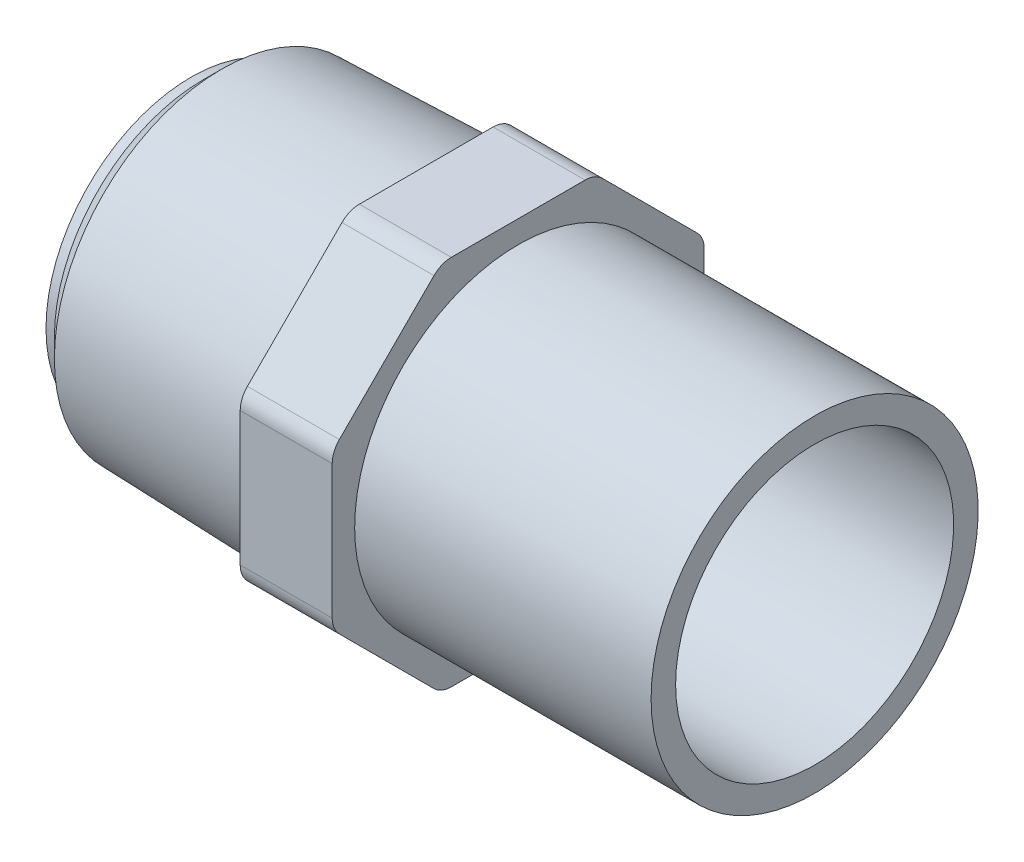
ISO-10303-21;
HEADER;
FILE_DESCRIPTION(('STEP AP214'),'2;1');
FILE_NAME('part.step','',(''),(''),'','','');
FILE_SCHEMA(('AUTOMOTIVE_DESIGN { 1 0 10303 214 1 1 1 1 }'));
ENDSEC;
DATA;
#1=APPLICATION_CONTEXT('core data for automotive mechanical design processes');
#2=APPLICATION_PROTOCOL_DEFINITION('international standard','automotive_design',2000,#1);
#3=PRODUCT_CONTEXT('',#1,'mechanical');
#4=PRODUCT('Part','Part','',(#3));
#5=PRODUCT_RELATED_PRODUCT_CATEGORY('part','',(#4));
#6=PRODUCT_DEFINITION_FORMATION('','',#4);
#7=PRODUCT_DEFINITION_CONTEXT('part definition',#1,'design');
#8=PRODUCT_DEFINITION('design','',#6,#7);
#9=PRODUCT_DEFINITION_SHAPE('','',#8);
#10=(LENGTH_UNIT() NAMED_UNIT(*) SI_UNIT(.MILLI.,.METRE.));
#11=(NAMED_UNIT(*) PLANE_ANGLE_UNIT() SI_UNIT($,.RADIAN.));
#12=(NAMED_UNIT(*) SI_UNIT($,.STERADIAN.) SOLID_ANGLE_UNIT());
#13=UNCERTAINTY_MEASURE_WITH_UNIT(LENGTH_MEASURE(1.E-05),#10,'distance_accuracy_value','');
#14=(GEOMETRIC_REPRESENTATION_CONTEXT(3) GLOBAL_UNCERTAINTY_ASSIGNED_CONTEXT((#13)) GLOBAL_UNIT_ASSIGNED_CONTEXT((#10,
#11,#12)) REPRESENTATION_CONTEXT('',''));
#15=CARTESIAN_POINT('',(0.,0.,0.));
#16=DIRECTION('',(0.,0.,1.));
#17=DIRECTION('',(1.,0.,0.));
#18=AXIS2_PLACEMENT_3D('',#15,#16,#17);
#19=CARTESIAN_POINT('',(-38.,-18.2,18.2));
#20=DIRECTION('',(-1.,0.,0.));
#21=DIRECTION('',(0.,1.,0.));
#22=AXIS2_PLACEMENT_3D('',#19,#20,#21);
#23=PLANE('',#22);
#24=CARTESIAN_POINT('',(-38.,0.,0.));
#25=DIRECTION('',(1.,0.,0.));
#26=DIRECTION('',(0.,0.,-1.));
#27=AXIS2_PLACEMENT_3D('',#24,#25,#26);
#28=CIRCLE('',#27,16.9805562693508);
#29=CARTESIAN_POINT('',(-38.,0.,-16.9805562693508));
#30=VERTEX_POINT('',#29);
#31=EDGE_CURVE('E18',#30,#30,#28,.F.);
#32=ORIENTED_EDGE('',*,*,#31,.F.);
#33=EDGE_LOOP('',(#32));
#34=FACE_BOUND('',#33,.T.);
#35=CARTESIAN_POINT('',(-38.,-15.8,6.54457428549489));
#36=DIRECTION('',(1.,0.,0.));
#37=DIRECTION('',(0.,0.,-1.));
#38=AXIS2_PLACEMENT_3D('',#35,#36,#37);
#39=CIRCLE('',#38,2.40000000000001);
#40=CARTESIAN_POINT('',(-38.,-17.4970562748477,8.24163056034261));
#41=VERTEX_POINT('',#40);
#42=CARTESIAN_POINT('',(-38.,-18.2,6.54457428549489));
#43=VERTEX_POINT('',#42);
#44=EDGE_CURVE('E235',#41,#43,#39,.T.);
#45=ORIENTED_EDGE('',*,*,#44,.F.);
#46=DIRECTION('',(0.,-0.707106781186548,-0.707106781186547));
#47=VECTOR('',#46,1.);
#48=CARTESIAN_POINT('',(-38.,-12.8693434175952,12.8693434175952));
#49=LINE('',#48,#47);
#50=CARTESIAN_POINT('',(-38.,-8.24163056034262,17.4970562748477));
#51=VERTEX_POINT('',#50);
#52=EDGE_CURVE('E132',#51,#41,#49,.T.);
#53=ORIENTED_EDGE('',*,*,#52,.F.);
#54=CARTESIAN_POINT('',(-38.,-6.5445742854949,15.8));
#55=DIRECTION('',(1.,0.,0.));
#56=DIRECTION('',(0.,0.,-1.));
#57=AXIS2_PLACEMENT_3D('',#54,#55,#56);
#58=CIRCLE('',#57,2.40000000000002);
#59=CARTESIAN_POINT('',(-38.,-6.5445742854949,18.2));
#60=VERTEX_POINT('',#59);
#61=EDGE_CURVE('E126',#60,#51,#58,.T.);
#62=ORIENTED_EDGE('',*,*,#61,.F.);
#63=DIRECTION('',(0.,-1.,0.));
#64=VECTOR('',#63,1.);
#65=CARTESIAN_POINT('',(-38.,0.,18.2));
#66=LINE('',#65,#64);
#67=CARTESIAN_POINT('',(-38.,6.54457428549489,18.2));
#68=VERTEX_POINT('',#67);
#69=EDGE_CURVE('E131',#68,#60,#66,.T.);
#70=ORIENTED_EDGE('',*,*,#69,.F.);
#71=CARTESIAN_POINT('',(-38.,6.54457428549489,15.8));
#72=DIRECTION('',(1.,0.,0.));
#73=DIRECTION('',(0.,0.,-1.));
#74=AXIS2_PLACEMENT_3D('',#71,#72,#73);
#75=CIRCLE('',#74,2.40000000000003);
#76=CARTESIAN_POINT('',(-38.,8.24163056034262,17.4970562748477));
#77=VERTEX_POINT('',#76);
#78=EDGE_CURVE('E147',#77,#68,#75,.T.);
#79=ORIENTED_EDGE('',*,*,#78,.F.);
#80=DIRECTION('',(0.,-0.707106781186547,0.707106781186548));
#81=VECTOR('',#80,1.);
#82=CARTESIAN_POINT('',(-38.,12.8693434175952,12.8693434175952));
#83=LINE('',#82,#81);
#84=CARTESIAN_POINT('',(-38.,17.4970562748477,8.24163056034262));
#85=VERTEX_POINT('',#84);
#86=EDGE_CURVE('E151',#85,#77,#83,.T.);
#87=ORIENTED_EDGE('',*,*,#86,.F.);
#88=CARTESIAN_POINT('',(-38.,15.8,6.5445742854949));
#89=DIRECTION('',(1.,0.,0.));
#90=DIRECTION('',(0.,0.,-1.));
#91=AXIS2_PLACEMENT_3D('',#88,#89,#90);
#92=CIRCLE('',#91,2.40000000000001);
#93=CARTESIAN_POINT('',(-38.,18.2,6.5445742854949));
#94=VERTEX_POINT('',#93);
#95=EDGE_CURVE('E225',#94,#85,#92,.T.);
#96=ORIENTED_EDGE('',*,*,#95,.F.);
#97=DIRECTION('',(0.,0.,1.));
#98=VECTOR('',#97,1.);
#99=CARTESIAN_POINT('',(-38.,18.2,0.));
#100=LINE('',#99,#98);
#101=CARTESIAN_POINT('',(-38.,18.2,-6.54457428549489));
#102=VERTEX_POINT('',#101);
#103=EDGE_CURVE('E155',#102,#94,#100,.T.);
#104=ORIENTED_EDGE('',*,*,#103,.F.);
#105=CARTESIAN_POINT('',(-38.,15.8,-6.54457428549488));
#106=DIRECTION('',(1.,0.,0.));
#107=DIRECTION('',(0.,0.,-1.));
#108=AXIS2_PLACEMENT_3D('',#105,#106,#107);
#109=CIRCLE('',#108,2.40000000000003);
#110=CARTESIAN_POINT('',(-38.,17.4970562748477,-8.24163056034261));
#111=VERTEX_POINT('',#110);
#112=EDGE_CURVE('E227',#111,#102,#109,.T.);
#113=ORIENTED_EDGE('',*,*,#112,.F.);
#114=DIRECTION('',(0.,0.707106781186548,0.707106781186547));
#115=VECTOR('',#114,1.);
#116=CARTESIAN_POINT('',(-38.,12.8693434175952,-12.8693434175952));
#117=LINE('',#116,#115);
#118=CARTESIAN_POINT('',(-38.,8.24163056034262,-17.4970562748477));
#119=VERTEX_POINT('',#118);
#120=EDGE_CURVE('E159',#119,#111,#117,.T.);
#121=ORIENTED_EDGE('',*,*,#120,.F.);
#122=CARTESIAN_POINT('',(-38.,6.54457428549491,-15.8));
#123=DIRECTION('',(1.,0.,0.));
#124=DIRECTION('',(0.,0.,-1.));
#125=AXIS2_PLACEMENT_3D('',#122,#123,#124);
#126=CIRCLE('',#125,2.39999999999999);
#127=CARTESIAN_POINT('',(-38.,6.54457428549491,-18.2));
#128=VERTEX_POINT('',#127);
#129=EDGE_CURVE('E229',#128,#119,#126,.T.);
#130=ORIENTED_EDGE('',*,*,#129,.F.);
#131=DIRECTION('',(0.,1.,0.));
#132=VECTOR('',#131,1.);
#133=CARTESIAN_POINT('',(-38.,0.,-18.2));
#134=LINE('',#133,#132);
#135=CARTESIAN_POINT('',(-38.,-6.5445742854949,-18.2));
#136=VERTEX_POINT('',#135);
#137=EDGE_CURVE('E163',#136,#128,#134,.T.);
#138=ORIENTED_EDGE('',*,*,#137,.F.);
#139=CARTESIAN_POINT('',(-38.,-6.5445742854949,-15.8));
#140=DIRECTION('',(1.,0.,0.));
#141=DIRECTION('',(0.,0.,-1.));
#142=AXIS2_PLACEMENT_3D('',#139,#140,#141);
#143=CIRCLE('',#142,2.4);
#144=CARTESIAN_POINT('',(-38.,-8.24163056034261,-17.4970562748477));
#145=VERTEX_POINT('',#144);
#146=EDGE_CURVE('E231',#145,#136,#143,.T.);
#147=ORIENTED_EDGE('',*,*,#146,.F.);
#148=DIRECTION('',(0.,0.707106781186547,-0.707106781186548));
#149=VECTOR('',#148,1.);
#150=CARTESIAN_POINT('',(-38.,-12.8693434175952,-12.8693434175952));
#151=LINE('',#150,#149);
#152=CARTESIAN_POINT('',(-38.,-17.4970562748477,-8.24163056034262));
#153=VERTEX_POINT('',#152);
#154=EDGE_CURVE('E167',#153,#145,#151,.T.);
#155=ORIENTED_EDGE('',*,*,#154,.F.);
#156=CARTESIAN_POINT('',(-38.,-15.8,-6.54457428549492));
#157=DIRECTION('',(1.,0.,0.));
#158=DIRECTION('',(0.,0.,-1.));
#159=AXIS2_PLACEMENT_3D('',#156,#157,#158);
#160=CIRCLE('',#159,2.39999999999999);
#161=CARTESIAN_POINT('',(-38.,-18.2,-6.54457428549492));
#162=VERTEX_POINT('',#161);
#163=EDGE_CURVE('E233',#162,#153,#160,.T.);
#164=ORIENTED_EDGE('',*,*,#163,.F.);
#165=DIRECTION('',(0.,0.,-1.));
#166=VECTOR('',#165,1.);
#167=CARTESIAN_POINT('',(-38.,-18.2,0.));
#168=LINE('',#167,#166);
#169=EDGE_CURVE('E171',#43,#162,#168,.T.);
#170=ORIENTED_EDGE('',*,*,#169,.F.);
#171=EDGE_LOOP('',(#45,#53,#62,#70,#79,#87,#96,#104,#113,#121,#130,#138,#147,#155,#164,#170));
#172=FACE_BOUND('',#171,.T.);
#173=ADVANCED_FACE('F15',(#34,#172),#23,.T.);
#174=CARTESIAN_POINT('',(-58.0230979570329,0.,0.));
#175=DIRECTION('',(1.,0.,0.));
#176=DIRECTION('',(0.,0.,-1.));
#177=AXIS2_PLACEMENT_3D('',#174,#175,#176);
#178=CONICAL_SURFACE('',#177,16.3569020429671,0.0311366738555789);
#179=CARTESIAN_POINT('',(-58.0230979570329,0.,0.));
#180=DIRECTION('',(-1.,0.,0.));
#181=DIRECTION('',(0.,1.,0.));
#182=AXIS2_PLACEMENT_3D('',#179,#180,#181);
#183=CIRCLE('',#182,16.3569020429671);
#184=CARTESIAN_POINT('',(-58.0230979570329,16.3569020429671,0.));
#185=VERTEX_POINT('',#184);
#186=EDGE_CURVE('E143',#185,#185,#183,.T.);
#187=ORIENTED_EDGE('',*,*,#186,.F.);
#188=EDGE_LOOP('',(#187));
#189=FACE_BOUND('',#188,.T.);
#190=ORIENTED_EDGE('',*,*,#31,.T.);
#191=EDGE_LOOP('',(#190));
#192=FACE_BOUND('',#191,.T.);
#193=ADVANCED_FACE('F537',(#189,#192),#178,.T.);
#194=CARTESIAN_POINT('',(-29.,-6.5445742854949,15.8));
#195=DIRECTION('',(1.,0.,0.));
#196=DIRECTION('',(0.,0.,-1.));
#197=AXIS2_PLACEMENT_3D('',#194,#195,#196);
#198=CYLINDRICAL_SURFACE('',#197,2.40000000000002);
#199=ORIENTED_EDGE('',*,*,#61,.T.);
#200=DIRECTION('',(1.,0.,0.));
#201=VECTOR('',#200,1.);
#202=CARTESIAN_POINT('',(-38.,-8.24163056034262,17.4970562748477));
#203=LINE('',#202,#201);
#204=CARTESIAN_POINT('',(-29.,-8.24163056034262,17.4970562748477));
#205=VERTEX_POINT('',#204);
#206=EDGE_CURVE('E135',#205,#51,#203,.F.);
#207=ORIENTED_EDGE('',*,*,#206,.F.);
#208=CARTESIAN_POINT('',(-29.,-6.5445742854949,15.8));
#209=DIRECTION('',(1.,0.,0.));
#210=DIRECTION('',(0.,0.,-1.));
#211=AXIS2_PLACEMENT_3D('',#208,#209,#210);
#212=CIRCLE('',#211,2.40000000000002);
#213=CARTESIAN_POINT('',(-29.,-6.5445742854949,18.2));
#214=VERTEX_POINT('',#213);
#215=EDGE_CURVE('E140',#214,#205,#212,.T.);
#216=ORIENTED_EDGE('',*,*,#215,.F.);
#217=DIRECTION('',(1.,0.,0.));
#218=VECTOR('',#217,1.);
#219=CARTESIAN_POINT('',(-38.,-6.54457428549491,18.2));
#220=LINE('',#219,#218);
#221=EDGE_CURVE('E137',#60,#214,#220,.T.);
#222=ORIENTED_EDGE('',*,*,#221,.F.);
#223=EDGE_LOOP('',(#199,#207,#216,#222));
#224=FACE_BOUND('',#223,.T.);
#225=ADVANCED_FACE('F138',(#224),#198,.T.);
#226=CARTESIAN_POINT('',(-38.,-8.24163056034262,17.4970562748477));
#227=DIRECTION('',(0.,-0.707106781186547,0.707106781186548));
#228=DIRECTION('',(0.,-0.707106781186548,-0.707106781186547));
#229=AXIS2_PLACEMENT_3D('',#226,#227,#228);
#230=PLANE('',#229);
#231=ORIENTED_EDGE('',*,*,#52,.T.);
#232=DIRECTION('',(-1.,0.,0.));
#233=VECTOR('',#232,1.);
#234=CARTESIAN_POINT('',(-33.5,-17.4970562748477,8.24163056034261));
#235=LINE('',#234,#233);
#236=CARTESIAN_POINT('',(-29.,-17.4970562748477,8.24163056034261));
#237=VERTEX_POINT('',#236);
#238=EDGE_CURVE('E175',#237,#41,#235,.T.);
#239=ORIENTED_EDGE('',*,*,#238,.F.);
#240=CARTESIAN_POINT('',(-29.,-8.24163056034263,17.4970562748477));
#241=CARTESIAN_POINT('',(-29.,-8.62727329844701,17.1114135367433));
#242=CARTESIAN_POINT('',(-29.,-9.01291603655139,16.7257707986389));
#243=CARTESIAN_POINT('',(-29.,-9.78420151276015,15.9544853224302));
#244=CARTESIAN_POINT('',(-29.,-10.1698442508645,15.5688425843258));
#245=CARTESIAN_POINT('',(-29.,-10.9411297270733,14.7975571081171));
#246=CARTESIAN_POINT('',(-29.,-11.3267724651777,14.4119143700127));
#247=CARTESIAN_POINT('',(-29.,-12.0980579413864,13.6406288938039));
#248=CARTESIAN_POINT('',(-29.,-12.4837006794908,13.2549861556995));
#249=CARTESIAN_POINT('',(-29.,-13.2549861556996,12.4837006794908));
#250=CARTESIAN_POINT('',(-29.,-13.6406288938039,12.0980579413864));
#251=CARTESIAN_POINT('',(-29.,-14.4119143700127,11.3267724651776));
#252=CARTESIAN_POINT('',(-29.,-14.7975571081171,10.9411297270733));
#253=CARTESIAN_POINT('',(-29.,-15.5688425843258,10.1698442508645));
#254=CARTESIAN_POINT('',(-29.,-15.9544853224302,9.78420151276013));
#255=CARTESIAN_POINT('',(-29.,-16.725770798639,9.01291603655137));
#256=CARTESIAN_POINT('',(-29.,-17.1114135367433,8.62727329844699));
#257=CARTESIAN_POINT('',(-29.,-17.4970562748477,8.24163056034261));
#258=B_SPLINE_CURVE_WITH_KNOTS('',3,(#240,#241,#242,#243,#244,#245,#246,#247,#248,#249,#250,
#251,#252,#253,#254,#255,#256,#257),.UNSPECIFIED.,.F.,.F.,(4,2,2,2,2,2,2,2,4),(0.,
1.63614357137373,3.27228714274745,4.90843071412117,6.5445742854949,8.18071785686862,
9.81686142824235,11.4530049996161,13.0891485709898),.UNSPECIFIED.);
#259=EDGE_CURVE('E222',#205,#237,#258,.T.);
#260=ORIENTED_EDGE('',*,*,#259,.F.);
#261=ORIENTED_EDGE('',*,*,#206,.T.);
#262=EDGE_LOOP('',(#231,#239,#260,#261));
#263=FACE_BOUND('',#262,.T.);
#264=ADVANCED_FACE('F369',(#263),#230,.T.);
#265=CARTESIAN_POINT('',(-29.,-15.8,6.54457428549489));
#266=DIRECTION('',(1.,0.,0.));
#267=DIRECTION('',(0.,0.,-1.));
#268=AXIS2_PLACEMENT_3D('',#265,#266,#267);
#269=CYLINDRICAL_SURFACE('',#268,2.40000000000001);
#270=ORIENTED_EDGE('',*,*,#44,.T.);
#271=DIRECTION('',(1.,0.,0.));
#272=VECTOR('',#271,1.);
#273=CARTESIAN_POINT('',(-38.,-18.2,6.54457428549489));
#274=LINE('',#273,#272);
#275=CARTESIAN_POINT('',(-29.,-18.2,6.54457428549489));
#276=VERTEX_POINT('',#275);
#277=EDGE_CURVE('E174',#276,#43,#274,.F.);
#278=ORIENTED_EDGE('',*,*,#277,.F.);
#279=CARTESIAN_POINT('',(-29.,-15.8,6.54457428549489));
#280=DIRECTION('',(1.,0.,0.));
#281=DIRECTION('',(0.,0.,-1.));
#282=AXIS2_PLACEMENT_3D('',#279,#280,#281);
#283=CIRCLE('',#282,2.40000000000001);
#284=EDGE_CURVE('E219',#237,#276,#283,.T.);
#285=ORIENTED_EDGE('',*,*,#284,.F.);
#286=ORIENTED_EDGE('',*,*,#238,.T.);
#287=EDGE_LOOP('',(#270,#278,#285,#286));
#288=FACE_BOUND('',#287,.T.);
#289=ADVANCED_FACE('F370',(#288),#269,.T.);
#290=CARTESIAN_POINT('',(-38.,-18.2,6.54457428549489));
#291=DIRECTION('',(0.,-1.,0.));
#292=DIRECTION('',(0.,0.,-1.));
#293=AXIS2_PLACEMENT_3D('',#290,#291,#292);
#294=PLANE('',#293);
#295=ORIENTED_EDGE('',*,*,#169,.T.);
#296=DIRECTION('',(-1.,0.,0.));
#297=VECTOR('',#296,1.);
#298=CARTESIAN_POINT('',(-33.5,-18.2,-6.54457428549491));
#299=LINE('',#298,#297);
#300=CARTESIAN_POINT('',(-29.,-18.2,-6.54457428549491));
#301=VERTEX_POINT('',#300);
#302=EDGE_CURVE('E173',#301,#162,#299,.T.);
#303=ORIENTED_EDGE('',*,*,#302,.F.);
#304=DIRECTION('',(0.,0.,-1.));
#305=VECTOR('',#304,1.);
#306=CARTESIAN_POINT('',(-29.,-18.2,18.2));
#307=LINE('',#306,#305);
#308=EDGE_CURVE('E218',#276,#301,#307,.T.);
#309=ORIENTED_EDGE('',*,*,#308,.F.);
#310=ORIENTED_EDGE('',*,*,#277,.T.);
#311=EDGE_LOOP('',(#295,#303,#309,#310));
#312=FACE_BOUND('',#311,.T.);
#313=ADVANCED_FACE('F326',(#312),#294,.T.);
#314=CARTESIAN_POINT('',(-29.,-15.8,-6.54457428549492));
#315=DIRECTION('',(1.,0.,0.));
#316=DIRECTION('',(0.,0.,-1.));
#317=AXIS2_PLACEMENT_3D('',#314,#315,#316);
#318=CYLINDRICAL_SURFACE('',#317,2.39999999999999);
#319=ORIENTED_EDGE('',*,*,#163,.T.);
#320=DIRECTION('',(1.,0.,0.));
#321=VECTOR('',#320,1.);
#322=CARTESIAN_POINT('',(-38.,-17.4970562748477,-8.24163056034262));
#323=LINE('',#322,#321);
#324=CARTESIAN_POINT('',(-29.,-17.4970562748477,-8.24163056034262));
#325=VERTEX_POINT('',#324);
#326=EDGE_CURVE('E170',#325,#153,#323,.F.);
#327=ORIENTED_EDGE('',*,*,#326,.F.);
#328=CARTESIAN_POINT('',(-29.,-15.8,-6.54457428549492));
#329=DIRECTION('',(1.,0.,0.));
#330=DIRECTION('',(0.,0.,-1.));
#331=AXIS2_PLACEMENT_3D('',#328,#329,#330);
#332=CIRCLE('',#331,2.39999999999999);
#333=EDGE_CURVE('E215',#301,#325,#332,.T.);
#334=ORIENTED_EDGE('',*,*,#333,.F.);
#335=ORIENTED_EDGE('',*,*,#302,.T.);
#336=EDGE_LOOP('',(#319,#327,#334,#335));
#337=FACE_BOUND('',#336,.T.);
#338=ADVANCED_FACE('F329',(#337),#318,.T.);
#339=CARTESIAN_POINT('',(-38.,-17.4970562748477,-8.24163056034262));
#340=DIRECTION('',(0.,-0.707106781186548,-0.707106781186547));
#341=DIRECTION('',(0.,0.707106781186547,-0.707106781186548));
#342=AXIS2_PLACEMENT_3D('',#339,#340,#341);
#343=PLANE('',#342);
#344=ORIENTED_EDGE('',*,*,#154,.T.);
#345=DIRECTION('',(-1.,0.,0.));
#346=VECTOR('',#345,1.);
#347=CARTESIAN_POINT('',(-33.5,-8.24163056034261,-17.4970562748477));
#348=LINE('',#347,#346);
#349=CARTESIAN_POINT('',(-29.,-8.24163056034261,-17.4970562748477));
#350=VERTEX_POINT('',#349);
#351=EDGE_CURVE('E169',#350,#145,#348,.T.);
#352=ORIENTED_EDGE('',*,*,#351,.F.);
#353=CARTESIAN_POINT('',(-29.,-17.4970562748477,-8.24163056034262));
#354=CARTESIAN_POINT('',(-29.,-17.1114135367433,-8.627273298447));
#355=CARTESIAN_POINT('',(-29.,-16.7257707986389,-9.01291603655138));
#356=CARTESIAN_POINT('',(-29.,-15.9544853224302,-9.78420151276014));
#357=CARTESIAN_POINT('',(-29.,-15.5688425843258,-10.1698442508645));
#358=CARTESIAN_POINT('',(-29.,-14.7975571081171,-10.9411297270733));
#359=CARTESIAN_POINT('',(-29.,-14.4119143700127,-11.3267724651777));
#360=CARTESIAN_POINT('',(-29.,-13.6406288938039,-12.0980579413864));
#361=CARTESIAN_POINT('',(-29.,-13.2549861556995,-12.4837006794908));
#362=CARTESIAN_POINT('',(-29.,-12.4837006794908,-13.2549861556995));
#363=CARTESIAN_POINT('',(-29.,-12.0980579413864,-13.6406288938039));
#364=CARTESIAN_POINT('',(-29.,-11.3267724651776,-14.4119143700127));
#365=CARTESIAN_POINT('',(-29.,-10.9411297270733,-14.7975571081171));
#366=CARTESIAN_POINT('',(-29.,-10.1698442508645,-15.5688425843258));
#367=CARTESIAN_POINT('',(-29.,-9.78420151276012,-15.9544853224302));
#368=CARTESIAN_POINT('',(-29.,-9.01291603655137,-16.725770798639));
#369=CARTESIAN_POINT('',(-29.,-8.62727329844699,-17.1114135367433));
#370=CARTESIAN_POINT('',(-29.,-8.24163056034261,-17.4970562748477));
#371=B_SPLINE_CURVE_WITH_KNOTS('',3,(#353,#354,#355,#356,#357,#358,#359,#360,#361,#362,#363,
#364,#365,#366,#367,#368,#369,#370),.UNSPECIFIED.,.F.,.F.,(4,2,2,2,2,2,2,2,4),(0.,
1.63614357137373,3.27228714274745,4.90843071412118,6.5445742854949,8.18071785686862,
9.81686142824235,11.4530049996161,13.0891485709898),.UNSPECIFIED.);
#372=EDGE_CURVE('E214',#325,#350,#371,.T.);
#373=ORIENTED_EDGE('',*,*,#372,.F.);
#374=ORIENTED_EDGE('',*,*,#326,.T.);
#375=EDGE_LOOP('',(#344,#352,#373,#374));
#376=FACE_BOUND('',#375,.T.);
#377=ADVANCED_FACE('F333',(#376),#343,.T.);
#378=CARTESIAN_POINT('',(-29.,-6.5445742854949,-15.8));
#379=DIRECTION('',(1.,0.,0.));
#380=DIRECTION('',(0.,0.,-1.));
#381=AXIS2_PLACEMENT_3D('',#378,#379,#380);
#382=CYLINDRICAL_SURFACE('',#381,2.4);
#383=ORIENTED_EDGE('',*,*,#146,.T.);
#384=DIRECTION('',(1.,0.,0.));
#385=VECTOR('',#384,1.);
#386=CARTESIAN_POINT('',(-38.,-6.5445742854949,-18.2));
#387=LINE('',#386,#385);
#388=CARTESIAN_POINT('',(-29.,-6.5445742854949,-18.2));
#389=VERTEX_POINT('',#388);
#390=EDGE_CURVE('E166',#389,#136,#387,.F.);
#391=ORIENTED_EDGE('',*,*,#390,.F.);
#392=CARTESIAN_POINT('',(-29.,-6.5445742854949,-15.8));
#393=DIRECTION('',(1.,0.,0.));
#394=DIRECTION('',(0.,0.,-1.));
#395=AXIS2_PLACEMENT_3D('',#392,#393,#394);
#396=CIRCLE('',#395,2.4);
#397=EDGE_CURVE('E211',#350,#389,#396,.T.);
#398=ORIENTED_EDGE('',*,*,#397,.F.);
#399=ORIENTED_EDGE('',*,*,#351,.T.);
#400=EDGE_LOOP('',(#383,#391,#398,#399));
#401=FACE_BOUND('',#400,.T.);
#402=ADVANCED_FACE('F337',(#401),#382,.T.);
#403=CARTESIAN_POINT('',(-38.,-6.5445742854949,-18.2));
#404=DIRECTION('',(0.,0.,-1.));
#405=DIRECTION('',(0.,1.,0.));
#406=AXIS2_PLACEMENT_3D('',#403,#404,#405);
#407=PLANE('',#406);
#408=ORIENTED_EDGE('',*,*,#137,.T.);
#409=DIRECTION('',(-1.,0.,0.));
#410=VECTOR('',#409,1.);
#411=CARTESIAN_POINT('',(-33.5,6.5445742854949,-18.2));
#412=LINE('',#411,#410);
#413=CARTESIAN_POINT('',(-29.,6.5445742854949,-18.2));
#414=VERTEX_POINT('',#413);
#415=EDGE_CURVE('E165',#414,#128,#412,.T.);
#416=ORIENTED_EDGE('',*,*,#415,.F.);
#417=DIRECTION('',(0.,1.,0.));
#418=VECTOR('',#417,1.);
#419=CARTESIAN_POINT('',(-29.,0.,-18.2));
#420=LINE('',#419,#418);
#421=EDGE_CURVE('E210',#389,#414,#420,.T.);
#422=ORIENTED_EDGE('',*,*,#421,.F.);
#423=ORIENTED_EDGE('',*,*,#390,.T.);
#424=EDGE_LOOP('',(#408,#416,#422,#423));
#425=FACE_BOUND('',#424,.T.);
#426=ADVANCED_FACE('F341',(#425),#407,.T.);
#427=CARTESIAN_POINT('',(-29.,6.54457428549491,-15.8));
#428=DIRECTION('',(1.,0.,0.));
#429=DIRECTION('',(0.,0.,-1.));
#430=AXIS2_PLACEMENT_3D('',#427,#428,#429);
#431=CYLINDRICAL_SURFACE('',#430,2.39999999999999);
#432=ORIENTED_EDGE('',*,*,#129,.T.);
#433=DIRECTION('',(1.,0.,0.));
#434=VECTOR('',#433,1.);
#435=CARTESIAN_POINT('',(-38.,8.24163056034262,-17.4970562748477));
#436=LINE('',#435,#434);
#437=CARTESIAN_POINT('',(-29.,8.24163056034262,-17.4970562748477));
#438=VERTEX_POINT('',#437);
#439=EDGE_CURVE('E162',#438,#119,#436,.F.);
#440=ORIENTED_EDGE('',*,*,#439,.F.);
#441=CARTESIAN_POINT('',(-29.,6.54457428549491,-15.8));
#442=DIRECTION('',(1.,0.,0.));
#443=DIRECTION('',(0.,0.,-1.));
#444=AXIS2_PLACEMENT_3D('',#441,#442,#443);
#445=CIRCLE('',#444,2.39999999999999);
#446=EDGE_CURVE('E207',#414,#438,#445,.T.);
#447=ORIENTED_EDGE('',*,*,#446,.F.);
#448=ORIENTED_EDGE('',*,*,#415,.T.);
#449=EDGE_LOOP('',(#432,#440,#447,#448));
#450=FACE_BOUND('',#449,.T.);
#451=ADVANCED_FACE('F345',(#450),#431,.T.);
#452=CARTESIAN_POINT('',(-38.,8.24163056034262,-17.4970562748477));
#453=DIRECTION('',(0.,0.707106781186547,-0.707106781186548));
#454=DIRECTION('',(0.,0.707106781186548,0.707106781186547));
#455=AXIS2_PLACEMENT_3D('',#452,#453,#454);
#456=PLANE('',#455);
#457=ORIENTED_EDGE('',*,*,#120,.T.);
#458=DIRECTION('',(-1.,0.,0.));
#459=VECTOR('',#458,1.);
#460=CARTESIAN_POINT('',(-33.5,17.4970562748477,-8.24163056034261));
#461=LINE('',#460,#459);
#462=CARTESIAN_POINT('',(-29.,17.4970562748477,-8.24163056034261));
#463=VERTEX_POINT('',#462);
#464=EDGE_CURVE('E161',#463,#111,#461,.T.);
#465=ORIENTED_EDGE('',*,*,#464,.F.);
#466=CARTESIAN_POINT('',(-29.,8.24163056034262,-17.4970562748477));
#467=CARTESIAN_POINT('',(-29.,8.627273298447,-17.1114135367433));
#468=CARTESIAN_POINT('',(-29.,9.01291603655138,-16.725770798639));
#469=CARTESIAN_POINT('',(-29.,9.78420151276014,-15.9544853224302));
#470=CARTESIAN_POINT('',(-29.,10.1698442508645,-15.5688425843258));
#471=CARTESIAN_POINT('',(-29.,10.9411297270733,-14.7975571081171));
#472=CARTESIAN_POINT('',(-29.,11.3267724651777,-14.4119143700127));
#473=CARTESIAN_POINT('',(-29.,12.0980579413864,-13.6406288938039));
#474=CARTESIAN_POINT('',(-29.,12.4837006794908,-13.2549861556995));
#475=CARTESIAN_POINT('',(-29.,13.2549861556995,-12.4837006794908));
#476=CARTESIAN_POINT('',(-29.,13.6406288938039,-12.0980579413864));
#477=CARTESIAN_POINT('',(-29.,14.4119143700127,-11.3267724651776));
#478=CARTESIAN_POINT('',(-29.,14.7975571081171,-10.9411297270733));
#479=CARTESIAN_POINT('',(-29.,15.5688425843258,-10.1698442508645));
#480=CARTESIAN_POINT('',(-29.,15.9544853224302,-9.78420151276013));
#481=CARTESIAN_POINT('',(-29.,16.725770798639,-9.01291603655137));
#482=CARTESIAN_POINT('',(-29.,17.1114135367433,-8.62727329844699));
#483=CARTESIAN_POINT('',(-29.,17.4970562748477,-8.24163056034261));
#484=B_SPLINE_CURVE_WITH_KNOTS('',3,(#466,#467,#468,#469,#470,#471,#472,#473,#474,#475,#476,
#477,#478,#479,#480,#481,#482,#483),.UNSPECIFIED.,.F.,.F.,(4,2,2,2,2,2,2,2,4),(0.,
1.63614357137372,3.27228714274745,4.90843071412118,6.5445742854949,8.18071785686863,
9.81686142824235,11.4530049996161,13.0891485709898),.UNSPECIFIED.);
#485=EDGE_CURVE('E206',#438,#463,#484,.T.);
#486=ORIENTED_EDGE('',*,*,#485,.F.);
#487=ORIENTED_EDGE('',*,*,#439,.T.);
#488=EDGE_LOOP('',(#457,#465,#486,#487));
#489=FACE_BOUND('',#488,.T.);
#490=ADVANCED_FACE('F349',(#489),#456,.T.);
#491=CARTESIAN_POINT('',(-29.,15.8,-6.54457428549488));
#492=DIRECTION('',(1.,0.,0.));
#493=DIRECTION('',(0.,0.,-1.));
#494=AXIS2_PLACEMENT_3D('',#491,#492,#493);
#495=CYLINDRICAL_SURFACE('',#494,2.40000000000003);
#496=ORIENTED_EDGE('',*,*,#112,.T.);
#497=DIRECTION('',(1.,0.,0.));
#498=VECTOR('',#497,1.);
#499=CARTESIAN_POINT('',(-38.,18.2,-6.54457428549489));
#500=LINE('',#499,#498);
#501=CARTESIAN_POINT('',(-29.,18.2,-6.54457428549489));
#502=VERTEX_POINT('',#501);
#503=EDGE_CURVE('E158',#502,#102,#500,.F.);
#504=ORIENTED_EDGE('',*,*,#503,.F.);
#505=CARTESIAN_POINT('',(-29.,15.8,-6.54457428549488));
#506=DIRECTION('',(1.,0.,0.));
#507=DIRECTION('',(0.,0.,-1.));
#508=AXIS2_PLACEMENT_3D('',#505,#506,#507);
#509=CIRCLE('',#508,2.40000000000003);
#510=EDGE_CURVE('E203',#463,#502,#509,.T.);
#511=ORIENTED_EDGE('',*,*,#510,.F.);
#512=ORIENTED_EDGE('',*,*,#464,.T.);
#513=EDGE_LOOP('',(#496,#504,#511,#512));
#514=FACE_BOUND('',#513,.T.);
#515=ADVANCED_FACE('F353',(#514),#495,.T.);
#516=CARTESIAN_POINT('',(-38.,18.2,-6.54457428549489));
#517=DIRECTION('',(0.,1.,0.));
#518=DIRECTION('',(0.,0.,1.));
#519=AXIS2_PLACEMENT_3D('',#516,#517,#518);
#520=PLANE('',#519);
#521=ORIENTED_EDGE('',*,*,#103,.T.);
#522=DIRECTION('',(-1.,0.,0.));
#523=VECTOR('',#522,1.);
#524=CARTESIAN_POINT('',(-33.5,18.2,6.54457428549491));
#525=LINE('',#524,#523);
#526=CARTESIAN_POINT('',(-29.,18.2,6.5445742854949));
#527=VERTEX_POINT('',#526);
#528=EDGE_CURVE('E157',#527,#94,#525,.T.);
#529=ORIENTED_EDGE('',*,*,#528,.F.);
#530=DIRECTION('',(0.,0.,-1.));
#531=VECTOR('',#530,1.);
#532=CARTESIAN_POINT('',(-29.,18.2,18.2));
#533=LINE('',#532,#531);
#534=EDGE_CURVE('E202',#502,#527,#533,.F.);
#535=ORIENTED_EDGE('',*,*,#534,.F.);
#536=ORIENTED_EDGE('',*,*,#503,.T.);
#537=EDGE_LOOP('',(#521,#529,#535,#536));
#538=FACE_BOUND('',#537,.T.);
#539=ADVANCED_FACE('F357',(#538),#520,.T.);
#540=CARTESIAN_POINT('',(-29.,15.8,6.5445742854949));
#541=DIRECTION('',(1.,0.,0.));
#542=DIRECTION('',(0.,0.,-1.));
#543=AXIS2_PLACEMENT_3D('',#540,#541,#542);
#544=CYLINDRICAL_SURFACE('',#543,2.40000000000001);
#545=ORIENTED_EDGE('',*,*,#95,.T.);
#546=DIRECTION('',(1.,0.,0.));
#547=VECTOR('',#546,1.);
#548=CARTESIAN_POINT('',(-38.,17.4970562748477,8.24163056034262));
#549=LINE('',#548,#547);
#550=CARTESIAN_POINT('',(-29.,17.4970562748477,8.24163056034262));
#551=VERTEX_POINT('',#550);
#552=EDGE_CURVE('E154',#551,#85,#549,.F.);
#553=ORIENTED_EDGE('',*,*,#552,.F.);
#554=CARTESIAN_POINT('',(-29.,15.8,6.5445742854949));
#555=DIRECTION('',(1.,0.,0.));
#556=DIRECTION('',(0.,0.,-1.));
#557=AXIS2_PLACEMENT_3D('',#554,#555,#556);
#558=CIRCLE('',#557,2.40000000000001);
#559=EDGE_CURVE('E199',#527,#551,#558,.T.);
#560=ORIENTED_EDGE('',*,*,#559,.F.);
#561=ORIENTED_EDGE('',*,*,#528,.T.);
#562=EDGE_LOOP('',(#545,#553,#560,#561));
#563=FACE_BOUND('',#562,.T.);
#564=ADVANCED_FACE('F361',(#563),#544,.T.);
#565=CARTESIAN_POINT('',(-38.,17.4970562748477,8.24163056034262));
#566=DIRECTION('',(0.,0.707106781186548,0.707106781186547));
#567=DIRECTION('',(0.,-0.707106781186547,0.707106781186548));
#568=AXIS2_PLACEMENT_3D('',#565,#566,#567);
#569=PLANE('',#568);
#570=ORIENTED_EDGE('',*,*,#86,.T.);
#571=DIRECTION('',(-1.,0.,0.));
#572=VECTOR('',#571,1.);
#573=CARTESIAN_POINT('',(-33.5,8.24163056034262,17.4970562748477));
#574=LINE('',#573,#572);
#575=CARTESIAN_POINT('',(-29.,8.24163056034262,17.4970562748477));
#576=VERTEX_POINT('',#575);
#577=EDGE_CURVE('E153',#576,#77,#574,.T.);
#578=ORIENTED_EDGE('',*,*,#577,.F.);
#579=CARTESIAN_POINT('',(-29.,17.4970562748477,8.24163056034262));
#580=CARTESIAN_POINT('',(-29.,17.1114135367433,8.627273298447));
#581=CARTESIAN_POINT('',(-29.,16.725770798639,9.01291603655138));
#582=CARTESIAN_POINT('',(-29.,15.9544853224302,9.78420151276013));
#583=CARTESIAN_POINT('',(-29.,15.5688425843258,10.1698442508645));
#584=CARTESIAN_POINT('',(-29.,14.7975571081171,10.9411297270733));
#585=CARTESIAN_POINT('',(-29.,14.4119143700127,11.3267724651777));
#586=CARTESIAN_POINT('',(-29.,13.6406288938039,12.0980579413864));
#587=CARTESIAN_POINT('',(-29.,13.2549861556995,12.4837006794908));
#588=CARTESIAN_POINT('',(-29.,12.4837006794908,13.2549861556995));
#589=CARTESIAN_POINT('',(-29.,12.0980579413864,13.6406288938039));
#590=CARTESIAN_POINT('',(-29.,11.3267724651776,14.4119143700127));
#591=CARTESIAN_POINT('',(-29.,10.9411297270733,14.7975571081171));
#592=CARTESIAN_POINT('',(-29.,10.1698442508645,15.5688425843258));
#593=CARTESIAN_POINT('',(-29.,9.78420151276013,15.9544853224302));
#594=CARTESIAN_POINT('',(-29.,9.01291603655137,16.725770798639));
#595=CARTESIAN_POINT('',(-29.,8.62727329844699,17.1114135367433));
#596=CARTESIAN_POINT('',(-29.,8.24163056034262,17.4970562748477));
#597=B_SPLINE_CURVE_WITH_KNOTS('',3,(#579,#580,#581,#582,#583,#584,#585,#586,#587,#588,#589,
#590,#591,#592,#593,#594,#595,#596),.UNSPECIFIED.,.F.,.F.,(4,2,2,2,2,2,2,2,4),(0.,
1.63614357137372,3.27228714274745,4.90843071412117,6.5445742854949,8.18071785686863,
9.81686142824235,11.4530049996161,13.0891485709898),.UNSPECIFIED.);
#598=EDGE_CURVE('E198',#551,#576,#597,.T.);
#599=ORIENTED_EDGE('',*,*,#598,.F.);
#600=ORIENTED_EDGE('',*,*,#552,.T.);
#601=EDGE_LOOP('',(#570,#578,#599,#600));
#602=FACE_BOUND('',#601,.T.);
#603=ADVANCED_FACE('F365',(#602),#569,.T.);
#604=CARTESIAN_POINT('',(-29.,6.54457428549489,15.8));
#605=DIRECTION('',(1.,0.,0.));
#606=DIRECTION('',(0.,0.,-1.));
#607=AXIS2_PLACEMENT_3D('',#604,#605,#606);
#608=CYLINDRICAL_SURFACE('',#607,2.40000000000003);
#609=ORIENTED_EDGE('',*,*,#78,.T.);
#610=DIRECTION('',(1.,0.,0.));
#611=VECTOR('',#610,1.);
#612=CARTESIAN_POINT('',(-38.,6.5445742854949,18.2));
#613=LINE('',#612,#611);
#614=CARTESIAN_POINT('',(-29.,6.5445742854949,18.2));
#615=VERTEX_POINT('',#614);
#616=EDGE_CURVE('E33',#615,#68,#613,.F.);
#617=ORIENTED_EDGE('',*,*,#616,.F.);
#618=CARTESIAN_POINT('',(-29.,6.54457428549489,15.8));
#619=DIRECTION('',(1.,0.,0.));
#620=DIRECTION('',(0.,0.,-1.));
#621=AXIS2_PLACEMENT_3D('',#618,#619,#620);
#622=CIRCLE('',#621,2.40000000000003);
#623=EDGE_CURVE('E195',#576,#615,#622,.T.);
#624=ORIENTED_EDGE('',*,*,#623,.F.);
#625=ORIENTED_EDGE('',*,*,#577,.T.);
#626=EDGE_LOOP('',(#609,#617,#624,#625));
#627=FACE_BOUND('',#626,.T.);
#628=ADVANCED_FACE('F366',(#627),#608,.T.);
#629=CARTESIAN_POINT('',(-38.,6.5445742854949,18.2));
#630=DIRECTION('',(0.,0.,1.));
#631=DIRECTION('',(0.,-1.,0.));
#632=AXIS2_PLACEMENT_3D('',#629,#630,#631);
#633=PLANE('',#632);
#634=ORIENTED_EDGE('',*,*,#69,.T.);
#635=ORIENTED_EDGE('',*,*,#221,.T.);
#636=DIRECTION('',(0.,-1.,0.));
#637=VECTOR('',#636,1.);
#638=CARTESIAN_POINT('',(-29.,0.,18.2));
#639=LINE('',#638,#637);
#640=EDGE_CURVE('E194',#615,#214,#639,.T.);
#641=ORIENTED_EDGE('',*,*,#640,.F.);
#642=ORIENTED_EDGE('',*,*,#616,.T.);
#643=EDGE_LOOP('',(#634,#635,#641,#642));
#644=FACE_BOUND('',#643,.T.);
#645=ADVANCED_FACE('F145',(#644),#633,.T.);
#646=CARTESIAN_POINT('',(-59.85,0.,0.));
#647=DIRECTION('',(1.,0.,0.));
#648=DIRECTION('',(0.,0.,-1.));
#649=AXIS2_PLACEMENT_3D('',#646,#647,#648);
#650=CONICAL_SURFACE('',#649,14.53,0.785398163397448);
#651=CARTESIAN_POINT('',(-59.85,0.,0.));
#652=DIRECTION('',(1.,0.,0.));
#653=DIRECTION('',(0.,0.,-1.));
#654=AXIS2_PLACEMENT_3D('',#651,#652,#653);
#655=CIRCLE('',#654,14.53);
#656=CARTESIAN_POINT('',(-59.85,0.,-14.53));
#657=VERTEX_POINT('',#656);
#658=EDGE_CURVE('E191',#657,#657,#655,.F.);
#659=ORIENTED_EDGE('',*,*,#658,.F.);
#660=EDGE_LOOP('',(#659));
#661=FACE_BOUND('',#660,.T.);
#662=ORIENTED_EDGE('',*,*,#186,.T.);
#663=EDGE_LOOP('',(#662));
#664=FACE_BOUND('',#663,.T.);
#665=ADVANCED_FACE('F412',(#661,#664),#650,.T.);
#666=CARTESIAN_POINT('',(-29.,18.2,18.2));
#667=DIRECTION('',(1.,0.,0.));
#668=DIRECTION('',(0.,-1.,0.));
#669=AXIS2_PLACEMENT_3D('',#666,#667,#668);
#670=PLANE('',#669);
#671=CARTESIAN_POINT('',(-29.,0.,0.));
#672=DIRECTION('',(-1.,0.,0.));
#673=DIRECTION('',(0.,0.,1.));
#674=AXIS2_PLACEMENT_3D('',#671,#672,#673);
#675=CIRCLE('',#674,16.);
#676=CARTESIAN_POINT('',(-29.,0.,16.));
#677=VERTEX_POINT('',#676);
#678=EDGE_CURVE('E188',#677,#677,#675,.F.);
#679=ORIENTED_EDGE('',*,*,#678,.F.);
#680=EDGE_LOOP('',(#679));
#681=FACE_BOUND('',#680,.T.);
#682=ORIENTED_EDGE('',*,*,#623,.T.);
#683=ORIENTED_EDGE('',*,*,#640,.T.);
#684=ORIENTED_EDGE('',*,*,#215,.T.);
#685=ORIENTED_EDGE('',*,*,#259,.T.);
#686=ORIENTED_EDGE('',*,*,#284,.T.);
#687=ORIENTED_EDGE('',*,*,#308,.T.);
#688=ORIENTED_EDGE('',*,*,#333,.T.);
#689=ORIENTED_EDGE('',*,*,#372,.T.);
#690=ORIENTED_EDGE('',*,*,#397,.T.);
#691=ORIENTED_EDGE('',*,*,#421,.T.);
#692=ORIENTED_EDGE('',*,*,#446,.T.);
#693=ORIENTED_EDGE('',*,*,#485,.T.);
#694=ORIENTED_EDGE('',*,*,#510,.T.);
#695=ORIENTED_EDGE('',*,*,#534,.T.);
#696=ORIENTED_EDGE('',*,*,#559,.T.);
#697=ORIENTED_EDGE('',*,*,#598,.T.);
#698=EDGE_LOOP('',(#682,#683,#684,#685,#686,#687,#688,#689,#690,#691,#692,#693,#694,#695,#696,#697));
#699=FACE_BOUND('',#698,.T.);
#700=ADVANCED_FACE('F260',(#681,#699),#670,.T.);
#701=CARTESIAN_POINT('',(-59.85,-14.53,14.704362108269));
#702=DIRECTION('',(-1.,0.,0.));
#703=DIRECTION('',(0.,1.,0.));
#704=AXIS2_PLACEMENT_3D('',#701,#702,#703);
#705=PLANE('',#704);
#706=CARTESIAN_POINT('',(-59.85,0.,0.));
#707=DIRECTION('',(-1.,0.,0.));
#708=DIRECTION('',(0.,0.,1.));
#709=AXIS2_PLACEMENT_3D('',#706,#707,#708);
#710=CIRCLE('',#709,14.2);
#711=CARTESIAN_POINT('',(-59.85,0.,14.2));
#712=VERTEX_POINT('',#711);
#713=EDGE_CURVE('E185',#712,#712,#710,.T.);
#714=ORIENTED_EDGE('',*,*,#713,.F.);
#715=EDGE_LOOP('',(#714));
#716=FACE_BOUND('',#715,.T.);
#717=ORIENTED_EDGE('',*,*,#658,.T.);
#718=EDGE_LOOP('',(#717));
#719=FACE_BOUND('',#718,.T.);
#720=ADVANCED_FACE('F258',(#716,#719),#705,.T.);
#721=CARTESIAN_POINT('',(-29.,0.,0.));
#722=DIRECTION('',(-1.,0.,0.));
#723=DIRECTION('',(0.,0.,1.));
#724=AXIS2_PLACEMENT_3D('',#721,#722,#723);
#725=CYLINDRICAL_SURFACE('',#724,16.);
#726=ORIENTED_EDGE('',*,*,#678,.T.);
#727=EDGE_LOOP('',(#726));
#728=FACE_BOUND('',#727,.T.);
#729=CARTESIAN_POINT('',(0.,0.,0.));
#730=DIRECTION('',(-1.,0.,0.));
#731=DIRECTION('',(0.,0.,1.));
#732=AXIS2_PLACEMENT_3D('',#729,#730,#731);
#733=CIRCLE('',#732,16.);
#734=CARTESIAN_POINT('',(0.,0.,16.));
#735=VERTEX_POINT('',#734);
#736=EDGE_CURVE('E182',#735,#735,#733,.F.);
#737=ORIENTED_EDGE('',*,*,#736,.F.);
#738=EDGE_LOOP('',(#737));
#739=FACE_BOUND('',#738,.T.);
#740=ADVANCED_FACE('F398',(#728,#739),#725,.T.);
#741=CARTESIAN_POINT('',(-61.,0.,0.));
#742=DIRECTION('',(-1.,0.,0.));
#743=DIRECTION('',(0.,0.,1.));
#744=AXIS2_PLACEMENT_3D('',#741,#742,#743);
#745=CYLINDRICAL_SURFACE('',#744,14.2);
#746=CARTESIAN_POINT('',(-61.,0.,0.));
#747=DIRECTION('',(-1.,0.,0.));
#748=DIRECTION('',(0.,0.,1.));
#749=AXIS2_PLACEMENT_3D('',#746,#747,#748);
#750=CIRCLE('',#749,14.2);
#751=CARTESIAN_POINT('',(-61.,0.,14.2));
#752=VERTEX_POINT('',#751);
#753=EDGE_CURVE('E179',#752,#752,#750,.T.);
#754=ORIENTED_EDGE('',*,*,#753,.F.);
#755=EDGE_LOOP('',(#754));
#756=FACE_BOUND('',#755,.T.);
#757=ORIENTED_EDGE('',*,*,#713,.T.);
#758=EDGE_LOOP('',(#757));
#759=FACE_BOUND('',#758,.T.);
#760=ADVANCED_FACE('F395',(#756,#759),#745,.T.);
#761=CARTESIAN_POINT('',(0.,16.,16.1920021082986));
#762=DIRECTION('',(1.,0.,0.));
#763=DIRECTION('',(0.,-1.,0.));
#764=AXIS2_PLACEMENT_3D('',#761,#762,#763);
#765=PLANE('',#764);
#766=CARTESIAN_POINT('',(0.,0.,0.));
#767=DIRECTION('',(-1.,0.,0.));
#768=DIRECTION('',(0.,0.,1.));
#769=AXIS2_PLACEMENT_3D('',#766,#767,#768);
#770=CIRCLE('',#769,13.6);
#771=CARTESIAN_POINT('',(0.,0.,13.6));
#772=VERTEX_POINT('',#771);
#773=EDGE_CURVE('E24',#772,#772,#770,.F.);
#774=ORIENTED_EDGE('',*,*,#773,.F.);
#775=EDGE_LOOP('',(#774));
#776=FACE_BOUND('',#775,.T.);
#777=ORIENTED_EDGE('',*,*,#736,.T.);
#778=EDGE_LOOP('',(#777));
#779=FACE_BOUND('',#778,.T.);
#780=ADVANCED_FACE('F388',(#776,#779),#765,.T.);
#781=CARTESIAN_POINT('',(-61.,-14.2,14.3704021083186));
#782=DIRECTION('',(-1.,0.,0.));
#783=DIRECTION('',(0.,1.,0.));
#784=AXIS2_PLACEMENT_3D('',#781,#782,#783);
#785=PLANE('',#784);
#786=CARTESIAN_POINT('',(-61.,0.,0.));
#787=DIRECTION('',(-1.,0.,0.));
#788=DIRECTION('',(0.,0.,1.));
#789=AXIS2_PLACEMENT_3D('',#786,#787,#788);
#790=CIRCLE('',#789,13.6);
#791=CARTESIAN_POINT('',(-61.,0.,13.6));
#792=VERTEX_POINT('',#791);
#793=EDGE_CURVE('E9',#792,#792,#790,.T.);
#794=ORIENTED_EDGE('',*,*,#793,.F.);
#795=EDGE_LOOP('',(#794));
#796=FACE_BOUND('',#795,.T.);
#797=ORIENTED_EDGE('',*,*,#753,.T.);
#798=EDGE_LOOP('',(#797));
#799=FACE_BOUND('',#798,.T.);
#800=ADVANCED_FACE('F382',(#796,#799),#785,.T.);
#801=CARTESIAN_POINT('',(0.,0.,0.));
#802=DIRECTION('',(-1.,0.,0.));
#803=DIRECTION('',(0.,0.,1.));
#804=AXIS2_PLACEMENT_3D('',#801,#802,#803);
#805=CYLINDRICAL_SURFACE('',#804,13.6);
#806=ORIENTED_EDGE('',*,*,#773,.T.);
#807=EDGE_LOOP('',(#806));
#808=FACE_BOUND('',#807,.T.);
#809=ORIENTED_EDGE('',*,*,#793,.T.);
#810=EDGE_LOOP('',(#809));
#811=FACE_BOUND('',#810,.T.);
#812=ADVANCED_FACE('F380',(#808,#811),#805,.F.);
#813=CLOSED_SHELL('',(#173,#193,#225,#264,#289,#313,#338,#377,#402,#426,#451,#490,#515,#539,
#564,#603,#628,#645,#665,#700,#720,#740,#760,#780,#800,#812));
#814=MANIFOLD_SOLID_BREP('B1',#813);
#815=ADVANCED_BREP_SHAPE_REPRESENTATION('',(#18,#814),#14);
#816=SHAPE_DEFINITION_REPRESENTATION(#9,#815);
ENDSEC;
END-ISO-10303-21;
